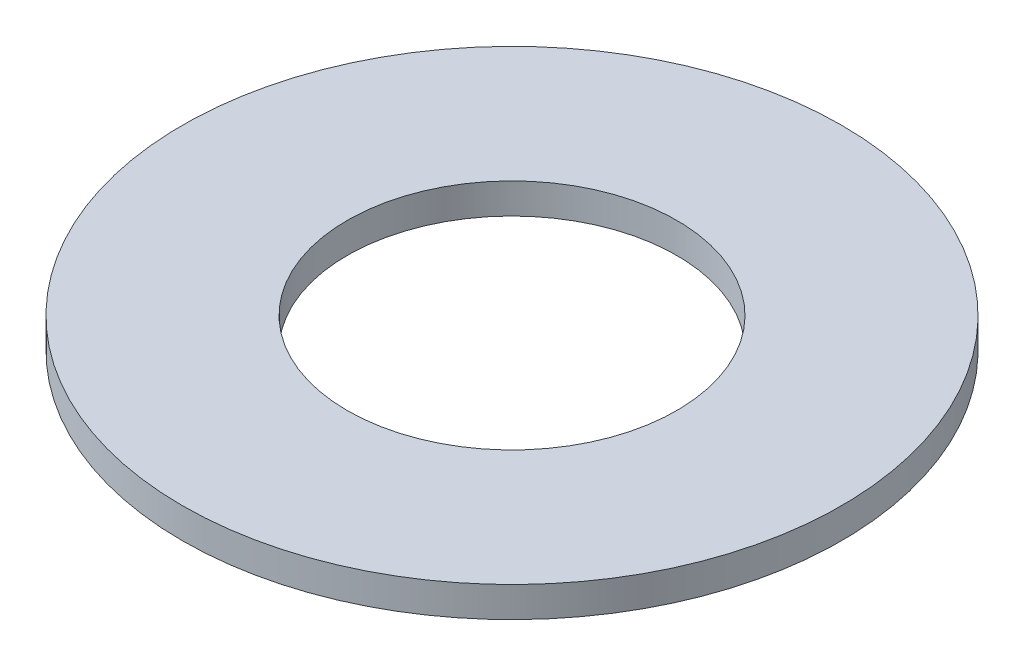
ISO-10303-21;
HEADER;
FILE_DESCRIPTION(('STEP AP214'),'2;1');
FILE_NAME('part.step','',(''),(''),'','','');
FILE_SCHEMA(('AUTOMOTIVE_DESIGN { 1 0 10303 214 1 1 1 1 }'));
ENDSEC;
DATA;
#1=APPLICATION_CONTEXT('core data for automotive mechanical design processes');
#2=APPLICATION_PROTOCOL_DEFINITION('international standard','automotive_design',2000,#1);
#3=PRODUCT_CONTEXT('',#1,'mechanical');
#4=PRODUCT('Part','Part','',(#3));
#5=PRODUCT_RELATED_PRODUCT_CATEGORY('part','',(#4));
#6=PRODUCT_DEFINITION_FORMATION('','',#4);
#7=PRODUCT_DEFINITION_CONTEXT('part definition',#1,'design');
#8=PRODUCT_DEFINITION('design','',#6,#7);
#9=PRODUCT_DEFINITION_SHAPE('','',#8);
#10=(LENGTH_UNIT() NAMED_UNIT(*) SI_UNIT(.MILLI.,.METRE.));
#11=(NAMED_UNIT(*) PLANE_ANGLE_UNIT() SI_UNIT($,.RADIAN.));
#12=(NAMED_UNIT(*) SI_UNIT($,.STERADIAN.) SOLID_ANGLE_UNIT());
#13=UNCERTAINTY_MEASURE_WITH_UNIT(LENGTH_MEASURE(1.E-05),#10,'distance_accuracy_value','');
#14=(GEOMETRIC_REPRESENTATION_CONTEXT(3) GLOBAL_UNCERTAINTY_ASSIGNED_CONTEXT((#13)) GLOBAL_UNIT_ASSIGNED_CONTEXT((#10,
#11,#12)) REPRESENTATION_CONTEXT('',''));
#15=CARTESIAN_POINT('',(0.,0.,0.));
#16=DIRECTION('',(0.,0.,1.));
#17=DIRECTION('',(1.,0.,0.));
#18=AXIS2_PLACEMENT_3D('',#15,#16,#17);
#19=CARTESIAN_POINT('',(0.,6.,0.));
#20=DIRECTION('',(0.,-1.,0.));
#21=DIRECTION('',(0.,0.,-1.));
#22=AXIS2_PLACEMENT_3D('',#19,#20,#21);
#23=CYLINDRICAL_SURFACE('',#22,65.);
#24=CARTESIAN_POINT('',(0.,6.,0.));
#25=DIRECTION('',(0.,1.,0.));
#26=DIRECTION('',(0.,0.,1.));
#27=AXIS2_PLACEMENT_3D('',#24,#25,#26);
#28=CIRCLE('',#27,65.);
#29=CARTESIAN_POINT('',(0.,6.,65.));
#30=VERTEX_POINT('',#29);
#31=EDGE_CURVE('E10',#30,#30,#28,.T.);
#32=ORIENTED_EDGE('',*,*,#31,.F.);
#33=EDGE_LOOP('',(#32));
#34=FACE_BOUND('',#33,.T.);
#35=CARTESIAN_POINT('',(0.,0.,0.));
#36=DIRECTION('',(0.,1.,0.));
#37=DIRECTION('',(0.,0.,1.));
#38=AXIS2_PLACEMENT_3D('',#35,#36,#37);
#39=CIRCLE('',#38,65.);
#40=CARTESIAN_POINT('',(0.,0.,65.));
#41=VERTEX_POINT('',#40);
#42=EDGE_CURVE('E37',#41,#41,#39,.T.);
#43=ORIENTED_EDGE('',*,*,#42,.T.);
#44=EDGE_LOOP('',(#43));
#45=FACE_BOUND('',#44,.T.);
#46=ADVANCED_FACE('F40',(#34,#45),#23,.T.);
#47=CARTESIAN_POINT('',(0.,6.,0.));
#48=DIRECTION('',(0.,1.,0.));
#49=DIRECTION('',(0.,0.,1.));
#50=AXIS2_PLACEMENT_3D('',#47,#48,#49);
#51=PLANE('',#50);
#52=CARTESIAN_POINT('',(0.,6.,0.));
#53=DIRECTION('',(0.,1.,0.));
#54=DIRECTION('',(0.,0.,1.));
#55=AXIS2_PLACEMENT_3D('',#52,#53,#54);
#56=CIRCLE('',#55,32.5);
#57=CARTESIAN_POINT('',(0.,6.,32.5));
#58=VERTEX_POINT('',#57);
#59=EDGE_CURVE('E50',#58,#58,#56,.T.);
#60=ORIENTED_EDGE('',*,*,#59,.F.);
#61=EDGE_LOOP('',(#60));
#62=FACE_BOUND('',#61,.T.);
#63=ORIENTED_EDGE('',*,*,#31,.T.);
#64=EDGE_LOOP('',(#63));
#65=FACE_BOUND('',#64,.T.);
#66=ADVANCED_FACE('F59',(#62,#65),#51,.T.);
#67=CARTESIAN_POINT('',(0.,0.,0.));
#68=DIRECTION('',(0.,1.,0.));
#69=DIRECTION('',(0.,0.,1.));
#70=AXIS2_PLACEMENT_3D('',#67,#68,#69);
#71=PLANE('',#70);
#72=CARTESIAN_POINT('',(0.,0.,0.));
#73=DIRECTION('',(0.,1.,0.));
#74=DIRECTION('',(0.,0.,1.));
#75=AXIS2_PLACEMENT_3D('',#72,#73,#74);
#76=CIRCLE('',#75,32.5);
#77=CARTESIAN_POINT('',(0.,0.,32.5));
#78=VERTEX_POINT('',#77);
#79=EDGE_CURVE('E47',#78,#78,#76,.T.);
#80=ORIENTED_EDGE('',*,*,#79,.T.);
#81=EDGE_LOOP('',(#80));
#82=FACE_BOUND('',#81,.T.);
#83=ORIENTED_EDGE('',*,*,#42,.F.);
#84=EDGE_LOOP('',(#83));
#85=FACE_BOUND('',#84,.T.);
#86=ADVANCED_FACE('F58',(#82,#85),#71,.F.);
#87=CARTESIAN_POINT('',(0.,6.,0.));
#88=DIRECTION('',(0.,-1.,0.));
#89=DIRECTION('',(0.,0.,-1.));
#90=AXIS2_PLACEMENT_3D('',#87,#88,#89);
#91=CYLINDRICAL_SURFACE('',#90,32.5);
#92=ORIENTED_EDGE('',*,*,#59,.T.);
#93=EDGE_LOOP('',(#92));
#94=FACE_BOUND('',#93,.T.);
#95=ORIENTED_EDGE('',*,*,#79,.F.);
#96=EDGE_LOOP('',(#95));
#97=FACE_BOUND('',#96,.T.);
#98=ADVANCED_FACE('F54',(#94,#97),#91,.F.);
#99=CLOSED_SHELL('',(#46,#66,#86,#98));
#100=MANIFOLD_SOLID_BREP('B2',#99);
#101=ADVANCED_BREP_SHAPE_REPRESENTATION('',(#18,#100),#14);
#102=SHAPE_DEFINITION_REPRESENTATION(#9,#101);
ENDSEC;
END-ISO-10303-21;
